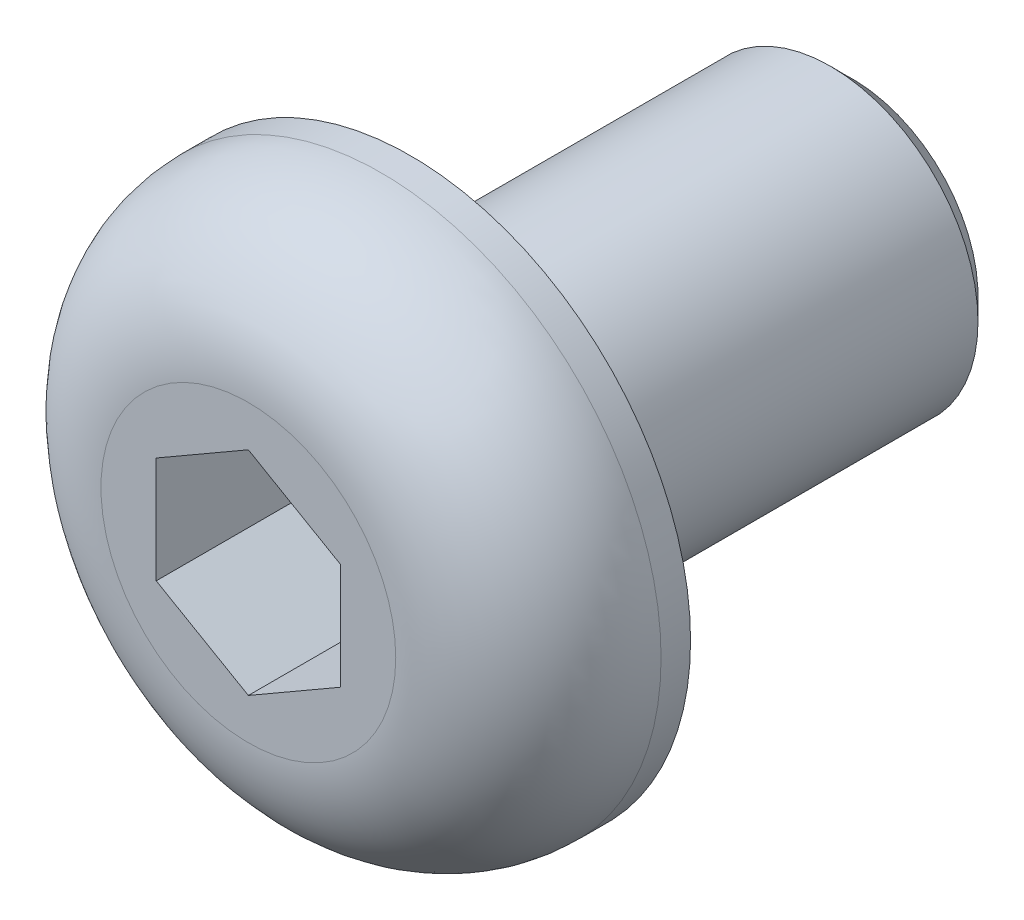
ISO-10303-21;
HEADER;
FILE_DESCRIPTION(('STEP AP214'),'2;1');
FILE_NAME('part.step','',(''),(''),'','','');
FILE_SCHEMA(('AUTOMOTIVE_DESIGN { 1 0 10303 214 1 1 1 1 }'));
ENDSEC;
DATA;
#1=APPLICATION_CONTEXT('core data for automotive mechanical design processes');
#2=APPLICATION_PROTOCOL_DEFINITION('international standard','automotive_design',2000,#1);
#3=PRODUCT_CONTEXT('',#1,'mechanical');
#4=PRODUCT('Part','Part','',(#3));
#5=PRODUCT_RELATED_PRODUCT_CATEGORY('part','',(#4));
#6=PRODUCT_DEFINITION_FORMATION('','',#4);
#7=PRODUCT_DEFINITION_CONTEXT('part definition',#1,'design');
#8=PRODUCT_DEFINITION('design','',#6,#7);
#9=PRODUCT_DEFINITION_SHAPE('','',#8);
#10=(LENGTH_UNIT() NAMED_UNIT(*) SI_UNIT(.MILLI.,.METRE.));
#11=(NAMED_UNIT(*) PLANE_ANGLE_UNIT() SI_UNIT($,.RADIAN.));
#12=(NAMED_UNIT(*) SI_UNIT($,.STERADIAN.) SOLID_ANGLE_UNIT());
#13=UNCERTAINTY_MEASURE_WITH_UNIT(LENGTH_MEASURE(1.E-05),#10,'distance_accuracy_value','');
#14=(GEOMETRIC_REPRESENTATION_CONTEXT(3) GLOBAL_UNCERTAINTY_ASSIGNED_CONTEXT((#13)) GLOBAL_UNIT_ASSIGNED_CONTEXT((#10,
#11,#12)) REPRESENTATION_CONTEXT('',''));
#15=CARTESIAN_POINT('',(0.,0.,0.));
#16=DIRECTION('',(0.,0.,1.));
#17=DIRECTION('',(1.,0.,0.));
#18=AXIS2_PLACEMENT_3D('',#15,#16,#17);
#19=CARTESIAN_POINT('',(0.,0.,0.));
#20=DIRECTION('',(0.,0.,1.));
#21=DIRECTION('',(1.,0.,0.));
#22=AXIS2_PLACEMENT_3D('',#19,#20,#21);
#23=PLANE('',#22);
#24=CARTESIAN_POINT('',(0.,0.,0.));
#25=DIRECTION('',(0.,0.,1.));
#26=DIRECTION('',(1.,0.,0.));
#27=AXIS2_PLACEMENT_3D('',#24,#25,#26);
#28=CIRCLE('',#27,3.8);
#29=CARTESIAN_POINT('',(3.8,0.,0.));
#30=VERTEX_POINT('',#29);
#31=EDGE_CURVE('E137',#30,#30,#28,.T.);
#32=ORIENTED_EDGE('',*,*,#31,.F.);
#33=EDGE_LOOP('',(#32));
#34=FACE_BOUND('',#33,.T.);
#35=CARTESIAN_POINT('',(0.,0.,0.));
#36=DIRECTION('',(0.,0.,1.));
#37=DIRECTION('',(1.,0.,0.));
#38=AXIS2_PLACEMENT_3D('',#35,#36,#37);
#39=CIRCLE('',#38,2.);
#40=CARTESIAN_POINT('',(2.,0.,0.));
#41=VERTEX_POINT('',#40);
#42=EDGE_CURVE('E145',#41,#41,#39,.F.);
#43=ORIENTED_EDGE('',*,*,#42,.F.);
#44=EDGE_LOOP('',(#43));
#45=FACE_BOUND('',#44,.T.);
#46=ADVANCED_FACE('F35',(#34,#45),#23,.F.);
#47=CARTESIAN_POINT('',(0.,0.,2.2));
#48=DIRECTION('',(0.,0.,-1.));
#49=DIRECTION('',(-1.,0.,0.));
#50=AXIS2_PLACEMENT_3D('',#47,#48,#49);
#51=CYLINDRICAL_SURFACE('',#50,3.8);
#52=CARTESIAN_POINT('',(0.,0.,0.4));
#53=DIRECTION('',(0.,0.,1.));
#54=DIRECTION('',(1.,0.,0.));
#55=AXIS2_PLACEMENT_3D('',#52,#53,#54);
#56=CIRCLE('',#55,3.8);
#57=CARTESIAN_POINT('',(3.8,0.,0.4));
#58=VERTEX_POINT('',#57);
#59=EDGE_CURVE('E11',#58,#58,#56,.F.);
#60=ORIENTED_EDGE('',*,*,#59,.T.);
#61=EDGE_LOOP('',(#60));
#62=FACE_BOUND('',#61,.T.);
#63=ORIENTED_EDGE('',*,*,#31,.T.);
#64=EDGE_LOOP('',(#63));
#65=FACE_BOUND('',#64,.T.);
#66=ADVANCED_FACE('F168',(#62,#65),#51,.T.);
#67=CARTESIAN_POINT('',(0.,0.,2.2));
#68=DIRECTION('',(0.,0.,1.));
#69=DIRECTION('',(1.,0.,0.));
#70=AXIS2_PLACEMENT_3D('',#67,#68,#69);
#71=PLANE('',#70);
#72=CARTESIAN_POINT('',(0.,0.,2.2));
#73=DIRECTION('',(0.,0.,1.));
#74=DIRECTION('',(1.,0.,0.));
#75=AXIS2_PLACEMENT_3D('',#72,#73,#74);
#76=CIRCLE('',#75,2.);
#77=CARTESIAN_POINT('',(2.,0.,2.2));
#78=VERTEX_POINT('',#77);
#79=EDGE_CURVE('E43',#78,#78,#76,.T.);
#80=ORIENTED_EDGE('',*,*,#79,.T.);
#81=EDGE_LOOP('',(#80));
#82=FACE_BOUND('',#81,.T.);
#83=DIRECTION('',(-0.866025403784439,0.5,0.));
#84=VECTOR('',#83,1.);
#85=CARTESIAN_POINT('',(1.25,0.721687836487033,2.2));
#86=LINE('',#85,#84);
#87=CARTESIAN_POINT('',(1.25,0.721687836487033,2.2));
#88=VERTEX_POINT('',#87);
#89=CARTESIAN_POINT('',(0.,1.44337567297406,2.2));
#90=VERTEX_POINT('',#89);
#91=EDGE_CURVE('E50',#88,#90,#86,.T.);
#92=ORIENTED_EDGE('',*,*,#91,.F.);
#93=DIRECTION('',(0.,1.,0.));
#94=VECTOR('',#93,1.);
#95=CARTESIAN_POINT('',(1.25,-0.721687836487033,2.2));
#96=LINE('',#95,#94);
#97=CARTESIAN_POINT('',(1.25,-0.721687836487033,2.2));
#98=VERTEX_POINT('',#97);
#99=EDGE_CURVE('E133',#98,#88,#96,.T.);
#100=ORIENTED_EDGE('',*,*,#99,.F.);
#101=DIRECTION('',(0.866025403784439,0.5,0.));
#102=VECTOR('',#101,1.);
#103=CARTESIAN_POINT('',(0.,-1.44337567297406,2.2));
#104=LINE('',#103,#102);
#105=CARTESIAN_POINT('',(0.,-1.44337567297406,2.2));
#106=VERTEX_POINT('',#105);
#107=EDGE_CURVE('E131',#106,#98,#104,.T.);
#108=ORIENTED_EDGE('',*,*,#107,.F.);
#109=DIRECTION('',(0.866025403784439,-0.5,0.));
#110=VECTOR('',#109,1.);
#111=CARTESIAN_POINT('',(-1.25,-0.721687836487032,2.2));
#112=LINE('',#111,#110);
#113=CARTESIAN_POINT('',(-1.25,-0.721687836487032,2.2));
#114=VERTEX_POINT('',#113);
#115=EDGE_CURVE('E98',#114,#106,#112,.T.);
#116=ORIENTED_EDGE('',*,*,#115,.F.);
#117=DIRECTION('',(0.,-1.,0.));
#118=VECTOR('',#117,1.);
#119=CARTESIAN_POINT('',(-1.25,0.721687836487033,2.2));
#120=LINE('',#119,#118);
#121=CARTESIAN_POINT('',(-1.25,0.721687836487033,2.2));
#122=VERTEX_POINT('',#121);
#123=EDGE_CURVE('E127',#122,#114,#120,.T.);
#124=ORIENTED_EDGE('',*,*,#123,.F.);
#125=DIRECTION('',(-0.866025403784439,-0.5,0.));
#126=VECTOR('',#125,1.);
#127=CARTESIAN_POINT('',(0.,1.44337567297406,2.2));
#128=LINE('',#127,#126);
#129=EDGE_CURVE('E124',#90,#122,#128,.T.);
#130=ORIENTED_EDGE('',*,*,#129,.F.);
#131=EDGE_LOOP('',(#92,#100,#108,#116,#124,#130));
#132=FACE_BOUND('',#131,.T.);
#133=ADVANCED_FACE('F156',(#82,#132),#71,.T.);
#134=CARTESIAN_POINT('',(0.,0.,-6.));
#135=DIRECTION('',(0.,0.,1.));
#136=DIRECTION('',(1.,0.,0.));
#137=AXIS2_PLACEMENT_3D('',#134,#135,#136);
#138=CYLINDRICAL_SURFACE('',#137,2.);
#139=CARTESIAN_POINT('',(0.,0.,-5.7));
#140=DIRECTION('',(0.,0.,-1.));
#141=DIRECTION('',(-1.,0.,0.));
#142=AXIS2_PLACEMENT_3D('',#139,#140,#141);
#143=CIRCLE('',#142,2.);
#144=CARTESIAN_POINT('',(-2.,0.,-5.7));
#145=VERTEX_POINT('',#144);
#146=EDGE_CURVE('E151',#145,#145,#143,.F.);
#147=ORIENTED_EDGE('',*,*,#146,.T.);
#148=EDGE_LOOP('',(#147));
#149=FACE_BOUND('',#148,.T.);
#150=ORIENTED_EDGE('',*,*,#42,.T.);
#151=EDGE_LOOP('',(#150));
#152=FACE_BOUND('',#151,.T.);
#153=ADVANCED_FACE('F191',(#149,#152),#138,.T.);
#154=CARTESIAN_POINT('',(0.,0.,-6.));
#155=DIRECTION('',(0.,0.,-1.));
#156=DIRECTION('',(-1.,0.,0.));
#157=AXIS2_PLACEMENT_3D('',#154,#155,#156);
#158=PLANE('',#157);
#159=CARTESIAN_POINT('',(0.,0.,-6.));
#160=DIRECTION('',(0.,0.,-1.));
#161=DIRECTION('',(-1.,0.,0.));
#162=AXIS2_PLACEMENT_3D('',#159,#160,#161);
#163=CIRCLE('',#162,1.7);
#164=CARTESIAN_POINT('',(-1.7,0.,-6.));
#165=VERTEX_POINT('',#164);
#166=EDGE_CURVE('E148',#165,#165,#163,.T.);
#167=ORIENTED_EDGE('',*,*,#166,.T.);
#168=EDGE_LOOP('',(#167));
#169=FACE_BOUND('',#168,.T.);
#170=ADVANCED_FACE('F183',(#169),#158,.T.);
#171=CARTESIAN_POINT('',(0.,0.,-6.));
#172=DIRECTION('',(0.,0.,1.));
#173=DIRECTION('',(1.,0.,0.));
#174=AXIS2_PLACEMENT_3D('',#171,#172,#173);
#175=CONICAL_SURFACE('',#174,1.7,0.785398163397447);
#176=ORIENTED_EDGE('',*,*,#146,.F.);
#177=EDGE_LOOP('',(#176));
#178=FACE_BOUND('',#177,.T.);
#179=ORIENTED_EDGE('',*,*,#166,.F.);
#180=EDGE_LOOP('',(#179));
#181=FACE_BOUND('',#180,.T.);
#182=ADVANCED_FACE('F180',(#178,#181),#175,.T.);
#183=CARTESIAN_POINT('',(1.25,0.721687836487033,0.2));
#184=DIRECTION('',(0.5,0.866025403784439,0.));
#185=DIRECTION('',(-0.866025403784439,0.5,0.));
#186=AXIS2_PLACEMENT_3D('',#183,#184,#185);
#187=PLANE('',#186);
#188=ORIENTED_EDGE('',*,*,#91,.T.);
#189=DIRECTION('',(0.,0.,1.));
#190=VECTOR('',#189,1.);
#191=CARTESIAN_POINT('',(0.,1.44337567297406,0.2));
#192=LINE('',#191,#190);
#193=CARTESIAN_POINT('',(0.,1.44337567297406,0.2));
#194=VERTEX_POINT('',#193);
#195=EDGE_CURVE('E80',#194,#90,#192,.T.);
#196=ORIENTED_EDGE('',*,*,#195,.F.);
#197=DIRECTION('',(-0.866025403784439,0.5,0.));
#198=VECTOR('',#197,1.);
#199=CARTESIAN_POINT('',(1.25,0.721687836487033,0.2));
#200=LINE('',#199,#198);
#201=CARTESIAN_POINT('',(1.25,0.721687836487033,0.2));
#202=VERTEX_POINT('',#201);
#203=EDGE_CURVE('E135',#202,#194,#200,.T.);
#204=ORIENTED_EDGE('',*,*,#203,.F.);
#205=DIRECTION('',(0.,0.,1.));
#206=VECTOR('',#205,1.);
#207=CARTESIAN_POINT('',(1.25,0.721687836487033,0.2));
#208=LINE('',#207,#206);
#209=EDGE_CURVE('E58',#202,#88,#208,.T.);
#210=ORIENTED_EDGE('',*,*,#209,.T.);
#211=EDGE_LOOP('',(#188,#196,#204,#210));
#212=FACE_BOUND('',#211,.T.);
#213=ADVANCED_FACE('F182',(#212),#187,.F.);
#214=CARTESIAN_POINT('',(1.25,-0.721687836487033,0.2));
#215=DIRECTION('',(1.,0.,0.));
#216=DIRECTION('',(0.,1.,0.));
#217=AXIS2_PLACEMENT_3D('',#214,#215,#216);
#218=PLANE('',#217);
#219=ORIENTED_EDGE('',*,*,#99,.T.);
#220=ORIENTED_EDGE('',*,*,#209,.F.);
#221=DIRECTION('',(0.,1.,0.));
#222=VECTOR('',#221,1.);
#223=CARTESIAN_POINT('',(1.25,-0.721687836487033,0.2));
#224=LINE('',#223,#222);
#225=CARTESIAN_POINT('',(1.25,-0.721687836487033,0.2));
#226=VERTEX_POINT('',#225);
#227=EDGE_CURVE('E110',#226,#202,#224,.T.);
#228=ORIENTED_EDGE('',*,*,#227,.F.);
#229=DIRECTION('',(0.,0.,1.));
#230=VECTOR('',#229,1.);
#231=CARTESIAN_POINT('',(1.25,-0.721687836487033,0.2));
#232=LINE('',#231,#230);
#233=EDGE_CURVE('E102',#226,#98,#232,.T.);
#234=ORIENTED_EDGE('',*,*,#233,.T.);
#235=EDGE_LOOP('',(#219,#220,#228,#234));
#236=FACE_BOUND('',#235,.T.);
#237=ADVANCED_FACE('F189',(#236),#218,.F.);
#238=CARTESIAN_POINT('',(0.,-1.44337567297406,0.2));
#239=DIRECTION('',(0.5,-0.866025403784439,0.));
#240=DIRECTION('',(0.866025403784439,0.5,0.));
#241=AXIS2_PLACEMENT_3D('',#238,#239,#240);
#242=PLANE('',#241);
#243=ORIENTED_EDGE('',*,*,#107,.T.);
#244=ORIENTED_EDGE('',*,*,#233,.F.);
#245=DIRECTION('',(0.866025403784439,0.5,0.));
#246=VECTOR('',#245,1.);
#247=CARTESIAN_POINT('',(0.,-1.44337567297406,0.2));
#248=LINE('',#247,#246);
#249=CARTESIAN_POINT('',(0.,-1.44337567297406,0.2));
#250=VERTEX_POINT('',#249);
#251=EDGE_CURVE('E106',#250,#226,#248,.T.);
#252=ORIENTED_EDGE('',*,*,#251,.F.);
#253=DIRECTION('',(0.,0.,1.));
#254=VECTOR('',#253,1.);
#255=CARTESIAN_POINT('',(0.,-1.44337567297406,0.2));
#256=LINE('',#255,#254);
#257=EDGE_CURVE('E91',#250,#106,#256,.T.);
#258=ORIENTED_EDGE('',*,*,#257,.T.);
#259=EDGE_LOOP('',(#243,#244,#252,#258));
#260=FACE_BOUND('',#259,.T.);
#261=ADVANCED_FACE('F107',(#260),#242,.F.);
#262=CARTESIAN_POINT('',(-1.25,-0.721687836487032,0.2));
#263=DIRECTION('',(-0.5,-0.866025403784439,0.));
#264=DIRECTION('',(0.866025403784439,-0.5,0.));
#265=AXIS2_PLACEMENT_3D('',#262,#263,#264);
#266=PLANE('',#265);
#267=ORIENTED_EDGE('',*,*,#115,.T.);
#268=ORIENTED_EDGE('',*,*,#257,.F.);
#269=DIRECTION('',(0.866025403784439,-0.5,0.));
#270=VECTOR('',#269,1.);
#271=CARTESIAN_POINT('',(-1.25,-0.721687836487032,0.2));
#272=LINE('',#271,#270);
#273=CARTESIAN_POINT('',(-1.25,-0.721687836487032,0.2));
#274=VERTEX_POINT('',#273);
#275=EDGE_CURVE('E95',#274,#250,#272,.T.);
#276=ORIENTED_EDGE('',*,*,#275,.F.);
#277=DIRECTION('',(0.,0.,1.));
#278=VECTOR('',#277,1.);
#279=CARTESIAN_POINT('',(-1.25,-0.721687836487032,0.2));
#280=LINE('',#279,#278);
#281=EDGE_CURVE('E103',#274,#114,#280,.T.);
#282=ORIENTED_EDGE('',*,*,#281,.T.);
#283=EDGE_LOOP('',(#267,#268,#276,#282));
#284=FACE_BOUND('',#283,.T.);
#285=ADVANCED_FACE('F93',(#284),#266,.F.);
#286=CARTESIAN_POINT('',(-1.25,0.721687836487033,0.2));
#287=DIRECTION('',(-1.,0.,0.));
#288=DIRECTION('',(0.,0.,1.));
#289=AXIS2_PLACEMENT_3D('',#286,#287,#288);
#290=PLANE('',#289);
#291=ORIENTED_EDGE('',*,*,#123,.T.);
#292=ORIENTED_EDGE('',*,*,#281,.F.);
#293=DIRECTION('',(0.,-1.,0.));
#294=VECTOR('',#293,1.);
#295=CARTESIAN_POINT('',(-1.25,0.721687836487033,0.2));
#296=LINE('',#295,#294);
#297=CARTESIAN_POINT('',(-1.25,0.721687836487033,0.2));
#298=VERTEX_POINT('',#297);
#299=EDGE_CURVE('E116',#298,#274,#296,.T.);
#300=ORIENTED_EDGE('',*,*,#299,.F.);
#301=DIRECTION('',(0.,0.,1.));
#302=VECTOR('',#301,1.);
#303=CARTESIAN_POINT('',(-1.25,0.721687836487033,0.2));
#304=LINE('',#303,#302);
#305=EDGE_CURVE('E140',#298,#122,#304,.T.);
#306=ORIENTED_EDGE('',*,*,#305,.T.);
#307=EDGE_LOOP('',(#291,#292,#300,#306));
#308=FACE_BOUND('',#307,.T.);
#309=ADVANCED_FACE('F207',(#308),#290,.F.);
#310=CARTESIAN_POINT('',(0.,1.44337567297406,0.2));
#311=DIRECTION('',(-0.5,0.866025403784439,0.));
#312=DIRECTION('',(-0.866025403784439,-0.5,0.));
#313=AXIS2_PLACEMENT_3D('',#310,#311,#312);
#314=PLANE('',#313);
#315=ORIENTED_EDGE('',*,*,#129,.T.);
#316=ORIENTED_EDGE('',*,*,#305,.F.);
#317=DIRECTION('',(-0.866025403784439,-0.5,0.));
#318=VECTOR('',#317,1.);
#319=CARTESIAN_POINT('',(0.,1.44337567297406,0.2));
#320=LINE('',#319,#318);
#321=EDGE_CURVE('E118',#194,#298,#320,.T.);
#322=ORIENTED_EDGE('',*,*,#321,.F.);
#323=ORIENTED_EDGE('',*,*,#195,.T.);
#324=EDGE_LOOP('',(#315,#316,#322,#323));
#325=FACE_BOUND('',#324,.T.);
#326=ADVANCED_FACE('F164',(#325),#314,.F.);
#327=CARTESIAN_POINT('',(0.,0.,0.2));
#328=DIRECTION('',(0.,0.,1.));
#329=DIRECTION('',(1.,0.,0.));
#330=AXIS2_PLACEMENT_3D('',#327,#328,#329);
#331=PLANE('',#330);
#332=ORIENTED_EDGE('',*,*,#203,.T.);
#333=ORIENTED_EDGE('',*,*,#321,.T.);
#334=ORIENTED_EDGE('',*,*,#299,.T.);
#335=ORIENTED_EDGE('',*,*,#275,.T.);
#336=ORIENTED_EDGE('',*,*,#251,.T.);
#337=ORIENTED_EDGE('',*,*,#227,.T.);
#338=EDGE_LOOP('',(#332,#333,#334,#335,#336,#337));
#339=FACE_BOUND('',#338,.T.);
#340=ADVANCED_FACE('F113',(#339),#331,.T.);
#341=CARTESIAN_POINT('',(0.,0.,0.4));
#342=DIRECTION('',(0.,0.,1.));
#343=DIRECTION('',(1.,0.,0.));
#344=AXIS2_PLACEMENT_3D('',#341,#342,#343);
#345=TOROIDAL_SURFACE('',#344,2.,1.8);
#346=ORIENTED_EDGE('',*,*,#59,.F.);
#347=EDGE_LOOP('',(#346));
#348=FACE_BOUND('',#347,.T.);
#349=ORIENTED_EDGE('',*,*,#79,.F.);
#350=EDGE_LOOP('',(#349));
#351=FACE_BOUND('',#350,.T.);
#352=ADVANCED_FACE('F37',(#348,#351),#345,.T.);
#353=CLOSED_SHELL('',(#46,#66,#133,#153,#170,#182,#213,#237,#261,#285,#309,#326,#340,#352));
#354=MANIFOLD_SOLID_BREP('B2',#353);
#355=ADVANCED_BREP_SHAPE_REPRESENTATION('',(#18,#354),#14);
#356=SHAPE_DEFINITION_REPRESENTATION(#9,#355);
ENDSEC;
END-ISO-10303-21;
